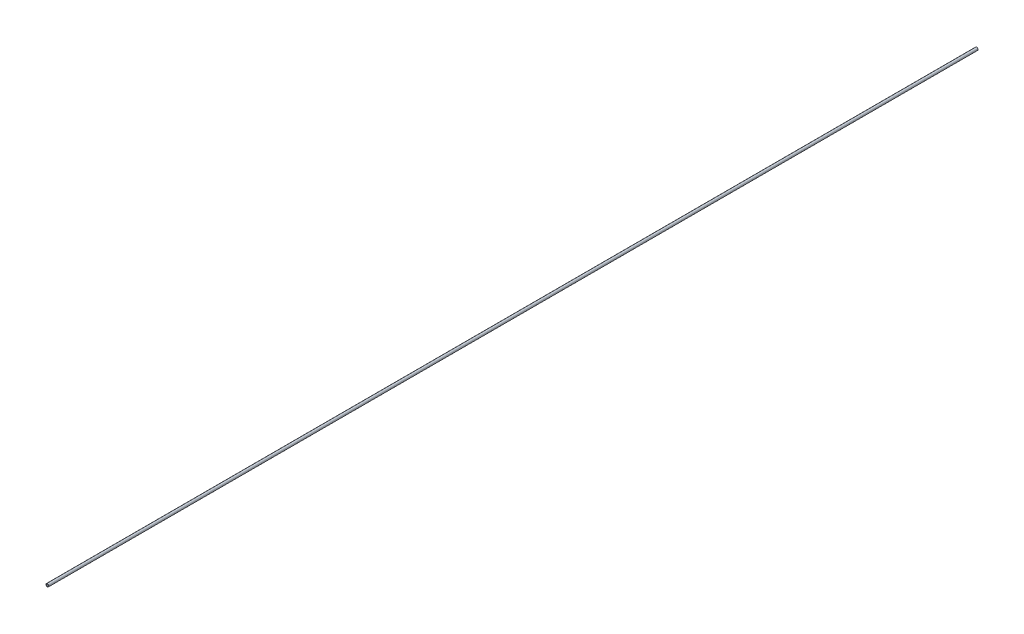
ISO-10303-21;
HEADER;
FILE_DESCRIPTION(('STEP AP214'),'2;1');
FILE_NAME('part.step','',(''),(''),'','','');
FILE_SCHEMA(('AUTOMOTIVE_DESIGN { 1 0 10303 214 1 1 1 1 }'));
ENDSEC;
DATA;
#1=APPLICATION_CONTEXT('core data for automotive mechanical design processes');
#2=APPLICATION_PROTOCOL_DEFINITION('international standard','automotive_design',2000,#1);
#3=PRODUCT_CONTEXT('',#1,'mechanical');
#4=PRODUCT('Part','Part','',(#3));
#5=PRODUCT_RELATED_PRODUCT_CATEGORY('part','',(#4));
#6=PRODUCT_DEFINITION_FORMATION('','',#4);
#7=PRODUCT_DEFINITION_CONTEXT('part definition',#1,'design');
#8=PRODUCT_DEFINITION('design','',#6,#7);
#9=PRODUCT_DEFINITION_SHAPE('','',#8);
#10=(LENGTH_UNIT() NAMED_UNIT(*) SI_UNIT(.MILLI.,.METRE.));
#11=(NAMED_UNIT(*) PLANE_ANGLE_UNIT() SI_UNIT($,.RADIAN.));
#12=(NAMED_UNIT(*) SI_UNIT($,.STERADIAN.) SOLID_ANGLE_UNIT());
#13=UNCERTAINTY_MEASURE_WITH_UNIT(LENGTH_MEASURE(1.E-05),#10,'distance_accuracy_value','');
#14=(GEOMETRIC_REPRESENTATION_CONTEXT(3) GLOBAL_UNCERTAINTY_ASSIGNED_CONTEXT((#13)) GLOBAL_UNIT_ASSIGNED_CONTEXT((#10,
#11,#12)) REPRESENTATION_CONTEXT('',''));
#15=CARTESIAN_POINT('',(0.,0.,0.));
#16=DIRECTION('',(0.,0.,1.));
#17=DIRECTION('',(1.,0.,0.));
#18=AXIS2_PLACEMENT_3D('',#15,#16,#17);
#19=CARTESIAN_POINT('',(0.,0.,2000.));
#20=DIRECTION('',(0.,0.,1.));
#21=DIRECTION('',(1.,0.,0.));
#22=AXIS2_PLACEMENT_3D('',#19,#20,#21);
#23=PLANE('',#22);
#24=CARTESIAN_POINT('',(0.,0.,2000.));
#25=DIRECTION('',(0.,0.,1.));
#26=DIRECTION('',(1.,0.,0.));
#27=AXIS2_PLACEMENT_3D('',#24,#25,#26);
#28=CIRCLE('',#27,3.);
#29=CARTESIAN_POINT('',(3.,0.,2000.));
#30=VERTEX_POINT('',#29);
#31=EDGE_CURVE('E10',#30,#30,#28,.T.);
#32=ORIENTED_EDGE('',*,*,#31,.T.);
#33=EDGE_LOOP('',(#32));
#34=FACE_BOUND('',#33,.T.);
#35=CARTESIAN_POINT('',(0.,0.,2000.));
#36=DIRECTION('',(0.,0.,1.));
#37=DIRECTION('',(1.,0.,0.));
#38=AXIS2_PLACEMENT_3D('',#35,#36,#37);
#39=CIRCLE('',#38,2.);
#40=CARTESIAN_POINT('',(2.,0.,2000.));
#41=VERTEX_POINT('',#40);
#42=EDGE_CURVE('E50',#41,#41,#39,.T.);
#43=ORIENTED_EDGE('',*,*,#42,.F.);
#44=EDGE_LOOP('',(#43));
#45=FACE_BOUND('',#44,.T.);
#46=ADVANCED_FACE('F39',(#34,#45),#23,.T.);
#47=CARTESIAN_POINT('',(0.,0.,0.));
#48=DIRECTION('',(0.,0.,1.));
#49=DIRECTION('',(1.,0.,0.));
#50=AXIS2_PLACEMENT_3D('',#47,#48,#49);
#51=PLANE('',#50);
#52=CARTESIAN_POINT('',(0.,0.,0.));
#53=DIRECTION('',(0.,0.,1.));
#54=DIRECTION('',(1.,0.,0.));
#55=AXIS2_PLACEMENT_3D('',#52,#53,#54);
#56=CIRCLE('',#55,3.);
#57=CARTESIAN_POINT('',(3.,0.,0.));
#58=VERTEX_POINT('',#57);
#59=EDGE_CURVE('E43',#58,#58,#56,.T.);
#60=ORIENTED_EDGE('',*,*,#59,.F.);
#61=EDGE_LOOP('',(#60));
#62=FACE_BOUND('',#61,.T.);
#63=CARTESIAN_POINT('',(0.,0.,0.));
#64=DIRECTION('',(0.,0.,1.));
#65=DIRECTION('',(1.,0.,0.));
#66=AXIS2_PLACEMENT_3D('',#63,#64,#65);
#67=CIRCLE('',#66,2.);
#68=CARTESIAN_POINT('',(2.,0.,0.));
#69=VERTEX_POINT('',#68);
#70=EDGE_CURVE('E52',#69,#69,#67,.T.);
#71=ORIENTED_EDGE('',*,*,#70,.T.);
#72=EDGE_LOOP('',(#71));
#73=FACE_BOUND('',#72,.T.);
#74=ADVANCED_FACE('F62',(#62,#73),#51,.F.);
#75=CARTESIAN_POINT('',(0.,0.,2000.));
#76=DIRECTION('',(0.,0.,-1.));
#77=DIRECTION('',(-1.,0.,0.));
#78=AXIS2_PLACEMENT_3D('',#75,#76,#77);
#79=CYLINDRICAL_SURFACE('',#78,3.);
#80=ORIENTED_EDGE('',*,*,#31,.F.);
#81=EDGE_LOOP('',(#80));
#82=FACE_BOUND('',#81,.T.);
#83=ORIENTED_EDGE('',*,*,#59,.T.);
#84=EDGE_LOOP('',(#83));
#85=FACE_BOUND('',#84,.T.);
#86=ADVANCED_FACE('F41',(#82,#85),#79,.T.);
#87=CARTESIAN_POINT('',(0.,0.,2000.));
#88=DIRECTION('',(0.,0.,-1.));
#89=DIRECTION('',(-1.,0.,0.));
#90=AXIS2_PLACEMENT_3D('',#87,#88,#89);
#91=CYLINDRICAL_SURFACE('',#90,2.);
#92=ORIENTED_EDGE('',*,*,#42,.T.);
#93=EDGE_LOOP('',(#92));
#94=FACE_BOUND('',#93,.T.);
#95=ORIENTED_EDGE('',*,*,#70,.F.);
#96=EDGE_LOOP('',(#95));
#97=FACE_BOUND('',#96,.T.);
#98=ADVANCED_FACE('F58',(#94,#97),#91,.F.);
#99=CLOSED_SHELL('',(#46,#74,#86,#98));
#100=MANIFOLD_SOLID_BREP('B2',#99);
#101=ADVANCED_BREP_SHAPE_REPRESENTATION('',(#18,#100),#14);
#102=SHAPE_DEFINITION_REPRESENTATION(#9,#101);
ENDSEC;
END-ISO-10303-21;
